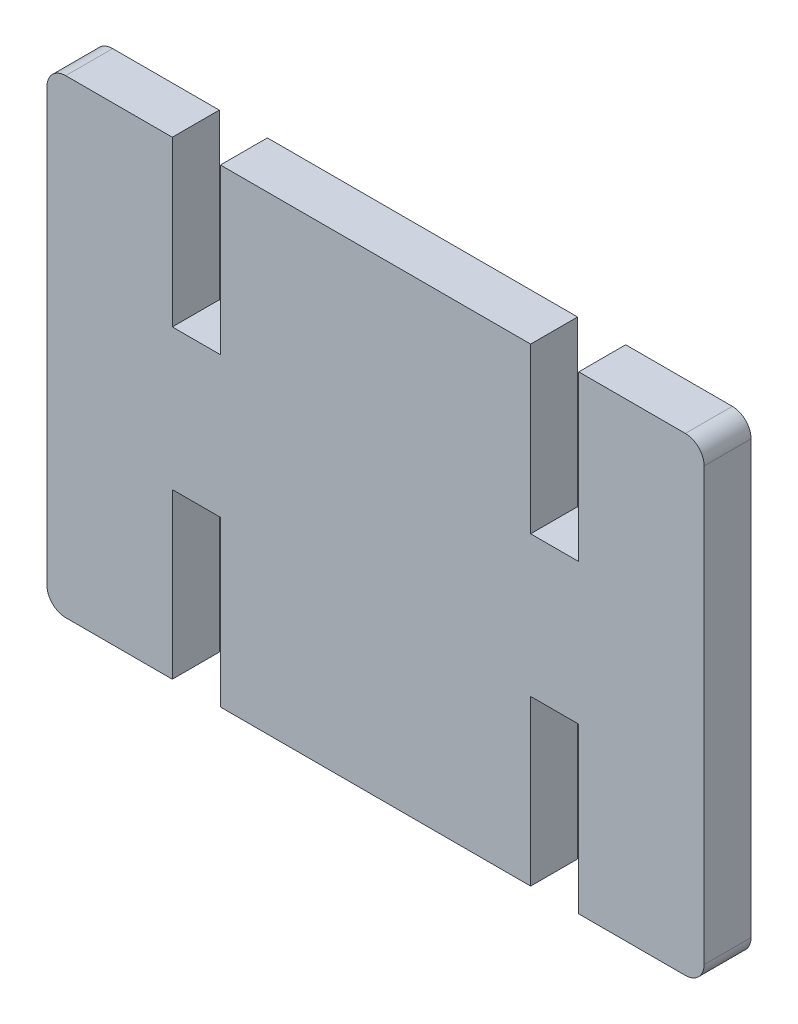
ISO-10303-21;
HEADER;
FILE_DESCRIPTION(('STEP AP214'),'2;1');
FILE_NAME('part.step','',(''),(''),'','','');
FILE_SCHEMA(('AUTOMOTIVE_DESIGN { 1 0 10303 214 1 1 1 1 }'));
ENDSEC;
DATA;
#1=APPLICATION_CONTEXT('core data for automotive mechanical design processes');
#2=APPLICATION_PROTOCOL_DEFINITION('international standard','automotive_design',2000,#1);
#3=PRODUCT_CONTEXT('',#1,'mechanical');
#4=PRODUCT('Part','Part','',(#3));
#5=PRODUCT_RELATED_PRODUCT_CATEGORY('part','',(#4));
#6=PRODUCT_DEFINITION_FORMATION('','',#4);
#7=PRODUCT_DEFINITION_CONTEXT('part definition',#1,'design');
#8=PRODUCT_DEFINITION('design','',#6,#7);
#9=PRODUCT_DEFINITION_SHAPE('','',#8);
#10=(LENGTH_UNIT() NAMED_UNIT(*) SI_UNIT(.MILLI.,.METRE.));
#11=(NAMED_UNIT(*) PLANE_ANGLE_UNIT() SI_UNIT($,.RADIAN.));
#12=(NAMED_UNIT(*) SI_UNIT($,.STERADIAN.) SOLID_ANGLE_UNIT());
#13=UNCERTAINTY_MEASURE_WITH_UNIT(LENGTH_MEASURE(1.E-05),#10,'distance_accuracy_value','');
#14=(GEOMETRIC_REPRESENTATION_CONTEXT(3) GLOBAL_UNCERTAINTY_ASSIGNED_CONTEXT((#13)) GLOBAL_UNIT_ASSIGNED_CONTEXT((#10,
#11,#12)) REPRESENTATION_CONTEXT('',''));
#15=CARTESIAN_POINT('',(0.,0.,0.));
#16=DIRECTION('',(0.,0.,1.));
#17=DIRECTION('',(1.,0.,0.));
#18=AXIS2_PLACEMENT_3D('',#15,#16,#17);
#19=CARTESIAN_POINT('',(2.00000000000001,0.,5.));
#20=DIRECTION('',(0.,1.,0.));
#21=DIRECTION('',(0.,0.,1.));
#22=AXIS2_PLACEMENT_3D('',#19,#20,#21);
#23=PLANE('',#22);
#24=DIRECTION('',(1.,0.,0.));
#25=VECTOR('',#24,1.);
#26=CARTESIAN_POINT('',(2.00000000000001,0.,0.));
#27=LINE('',#26,#25);
#28=CARTESIAN_POINT('',(18.479570248246,0.,0.));
#29=VERTEX_POINT('',#28);
#30=CARTESIAN_POINT('',(51.5204297517541,0.,0.));
#31=VERTEX_POINT('',#30);
#32=EDGE_CURVE('E217',#29,#31,#27,.T.);
#33=ORIENTED_EDGE('',*,*,#32,.T.);
#34=DIRECTION('',(0.,0.,1.));
#35=VECTOR('',#34,1.);
#36=CARTESIAN_POINT('',(51.5204297517541,0.,0.));
#37=LINE('',#36,#35);
#38=CARTESIAN_POINT('',(51.5204297517541,0.,5.00000000000002));
#39=VERTEX_POINT('',#38);
#40=EDGE_CURVE('E367',#31,#39,#37,.T.);
#41=ORIENTED_EDGE('',*,*,#40,.T.);
#42=DIRECTION('',(1.,0.,0.));
#43=VECTOR('',#42,1.);
#44=CARTESIAN_POINT('',(2.00000000000001,0.,5.));
#45=LINE('',#44,#43);
#46=CARTESIAN_POINT('',(18.479570248246,0.,5.00000000000002));
#47=VERTEX_POINT('',#46);
#48=EDGE_CURVE('E285',#47,#39,#45,.T.);
#49=ORIENTED_EDGE('',*,*,#48,.F.);
#50=DIRECTION('',(0.,0.,1.));
#51=VECTOR('',#50,1.);
#52=CARTESIAN_POINT('',(18.479570248246,0.,0.));
#53=LINE('',#52,#51);
#54=EDGE_CURVE('E350',#29,#47,#53,.T.);
#55=ORIENTED_EDGE('',*,*,#54,.F.);
#56=EDGE_LOOP('',(#33,#41,#49,#55));
#57=FACE_BOUND('',#56,.T.);
#58=ADVANCED_FACE('F33',(#57),#23,.F.);
#59=CARTESIAN_POINT('',(2.00000000000001,0.,0.));
#60=VERTEX_POINT('',#59);
#61=CARTESIAN_POINT('',(13.354570248246,0.,0.));
#62=VERTEX_POINT('',#61);
#63=EDGE_CURVE('E220',#60,#62,#27,.T.);
#64=ORIENTED_EDGE('',*,*,#63,.T.);
#65=DIRECTION('',(0.,0.,1.));
#66=VECTOR('',#65,1.);
#67=CARTESIAN_POINT('',(13.354570248246,0.,0.));
#68=LINE('',#67,#66);
#69=CARTESIAN_POINT('',(13.354570248246,0.,5.00000000000002));
#70=VERTEX_POINT('',#69);
#71=EDGE_CURVE('E342',#62,#70,#68,.T.);
#72=ORIENTED_EDGE('',*,*,#71,.T.);
#73=CARTESIAN_POINT('',(2.00000000000001,0.,5.));
#74=VERTEX_POINT('',#73);
#75=EDGE_CURVE('E282',#74,#70,#45,.T.);
#76=ORIENTED_EDGE('',*,*,#75,.F.);
#77=DIRECTION('',(0.,0.,-1.));
#78=VECTOR('',#77,1.);
#79=CARTESIAN_POINT('',(2.00000000000001,0.,5.));
#80=LINE('',#79,#78);
#81=EDGE_CURVE('E245',#74,#60,#80,.T.);
#82=ORIENTED_EDGE('',*,*,#81,.T.);
#83=EDGE_LOOP('',(#64,#72,#76,#82));
#84=FACE_BOUND('',#83,.T.);
#85=ADVANCED_FACE('F406',(#84),#23,.F.);
#86=CARTESIAN_POINT('',(2.00000000000001,50.,5.));
#87=DIRECTION('',(0.,-1.,0.));
#88=DIRECTION('',(0.,0.,-1.));
#89=AXIS2_PLACEMENT_3D('',#86,#87,#88);
#90=PLANE('',#89);
#91=DIRECTION('',(-1.,0.,0.));
#92=VECTOR('',#91,1.);
#93=CARTESIAN_POINT('',(2.00000000000001,50.,5.));
#94=LINE('',#93,#92);
#95=CARTESIAN_POINT('',(51.520429751754,50.,5.00000000000002));
#96=VERTEX_POINT('',#95);
#97=CARTESIAN_POINT('',(18.479570248246,50.,5.00000000000002));
#98=VERTEX_POINT('',#97);
#99=EDGE_CURVE('E294',#96,#98,#94,.T.);
#100=ORIENTED_EDGE('',*,*,#99,.F.);
#101=DIRECTION('',(0.,0.,1.));
#102=VECTOR('',#101,1.);
#103=CARTESIAN_POINT('',(51.520429751754,50.,0.));
#104=LINE('',#103,#102);
#105=CARTESIAN_POINT('',(51.520429751754,50.,0.));
#106=VERTEX_POINT('',#105);
#107=EDGE_CURVE('E330',#106,#96,#104,.T.);
#108=ORIENTED_EDGE('',*,*,#107,.F.);
#109=DIRECTION('',(-1.,0.,0.));
#110=VECTOR('',#109,1.);
#111=CARTESIAN_POINT('',(2.00000000000001,50.,0.));
#112=LINE('',#111,#110);
#113=CARTESIAN_POINT('',(18.479570248246,50.,0.));
#114=VERTEX_POINT('',#113);
#115=EDGE_CURVE('E272',#106,#114,#112,.T.);
#116=ORIENTED_EDGE('',*,*,#115,.T.);
#117=DIRECTION('',(0.,0.,1.));
#118=VECTOR('',#117,1.);
#119=CARTESIAN_POINT('',(18.479570248246,50.,0.));
#120=LINE('',#119,#118);
#121=EDGE_CURVE('E300',#114,#98,#120,.T.);
#122=ORIENTED_EDGE('',*,*,#121,.T.);
#123=EDGE_LOOP('',(#100,#108,#116,#122));
#124=FACE_BOUND('',#123,.T.);
#125=ADVANCED_FACE('F429',(#124),#90,.F.);
#126=CARTESIAN_POINT('',(13.354570248246,50.,5.00000000000002));
#127=VERTEX_POINT('',#126);
#128=CARTESIAN_POINT('',(2.00000000000001,50.,5.));
#129=VERTEX_POINT('',#128);
#130=EDGE_CURVE('E295',#127,#129,#94,.T.);
#131=ORIENTED_EDGE('',*,*,#130,.F.);
#132=DIRECTION('',(0.,0.,1.));
#133=VECTOR('',#132,1.);
#134=CARTESIAN_POINT('',(13.354570248246,50.,0.));
#135=LINE('',#134,#133);
#136=CARTESIAN_POINT('',(13.354570248246,50.,0.));
#137=VERTEX_POINT('',#136);
#138=EDGE_CURVE('E304',#137,#127,#135,.T.);
#139=ORIENTED_EDGE('',*,*,#138,.F.);
#140=CARTESIAN_POINT('',(2.00000000000001,50.,0.));
#141=VERTEX_POINT('',#140);
#142=EDGE_CURVE('E266',#137,#141,#112,.T.);
#143=ORIENTED_EDGE('',*,*,#142,.T.);
#144=DIRECTION('',(0.,0.,-1.));
#145=VECTOR('',#144,1.);
#146=CARTESIAN_POINT('',(2.00000000000001,50.,5.));
#147=LINE('',#146,#145);
#148=EDGE_CURVE('E41',#129,#141,#147,.T.);
#149=ORIENTED_EDGE('',*,*,#148,.F.);
#150=EDGE_LOOP('',(#131,#139,#143,#149));
#151=FACE_BOUND('',#150,.T.);
#152=ADVANCED_FACE('F509',(#151),#90,.F.);
#153=CARTESIAN_POINT('',(68.,48.,5.));
#154=DIRECTION('',(0.,0.,-1.));
#155=DIRECTION('',(-1.,0.,0.));
#156=AXIS2_PLACEMENT_3D('',#153,#154,#155);
#157=CYLINDRICAL_SURFACE('',#156,2.);
#158=CARTESIAN_POINT('',(68.,48.,0.));
#159=DIRECTION('',(0.,0.,1.));
#160=DIRECTION('',(1.,0.,0.));
#161=AXIS2_PLACEMENT_3D('',#158,#159,#160);
#162=CIRCLE('',#161,2.);
#163=CARTESIAN_POINT('',(70.,48.,0.));
#164=VERTEX_POINT('',#163);
#165=CARTESIAN_POINT('',(68.,50.,0.));
#166=VERTEX_POINT('',#165);
#167=EDGE_CURVE('E275',#164,#166,#162,.T.);
#168=ORIENTED_EDGE('',*,*,#167,.T.);
#169=DIRECTION('',(0.,0.,-1.));
#170=VECTOR('',#169,1.);
#171=CARTESIAN_POINT('',(68.,50.,5.));
#172=LINE('',#171,#170);
#173=CARTESIAN_POINT('',(68.,50.,5.));
#174=VERTEX_POINT('',#173);
#175=EDGE_CURVE('E11',#174,#166,#172,.T.);
#176=ORIENTED_EDGE('',*,*,#175,.F.);
#177=CARTESIAN_POINT('',(68.,48.,5.));
#178=DIRECTION('',(0.,0.,1.));
#179=DIRECTION('',(1.,0.,0.));
#180=AXIS2_PLACEMENT_3D('',#177,#178,#179);
#181=CIRCLE('',#180,2.);
#182=CARTESIAN_POINT('',(70.,48.,5.));
#183=VERTEX_POINT('',#182);
#184=EDGE_CURVE('E234',#183,#174,#181,.T.);
#185=ORIENTED_EDGE('',*,*,#184,.F.);
#186=DIRECTION('',(0.,0.,-1.));
#187=VECTOR('',#186,1.);
#188=CARTESIAN_POINT('',(70.,48.,5.));
#189=LINE('',#188,#187);
#190=EDGE_CURVE('E237',#183,#164,#189,.T.);
#191=ORIENTED_EDGE('',*,*,#190,.T.);
#192=EDGE_LOOP('',(#168,#176,#185,#191));
#193=FACE_BOUND('',#192,.T.);
#194=ADVANCED_FACE('F35',(#193),#157,.T.);
#195=CARTESIAN_POINT('',(56.645429751754,50.,0.));
#196=VERTEX_POINT('',#195);
#197=EDGE_CURVE('E268',#166,#196,#112,.T.);
#198=ORIENTED_EDGE('',*,*,#197,.T.);
#199=DIRECTION('',(0.,0.,1.));
#200=VECTOR('',#199,1.);
#201=CARTESIAN_POINT('',(56.645429751754,50.,0.));
#202=LINE('',#201,#200);
#203=CARTESIAN_POINT('',(56.645429751754,50.,5.00000000000002));
#204=VERTEX_POINT('',#203);
#205=EDGE_CURVE('E326',#196,#204,#202,.T.);
#206=ORIENTED_EDGE('',*,*,#205,.T.);
#207=EDGE_CURVE('E291',#174,#204,#94,.T.);
#208=ORIENTED_EDGE('',*,*,#207,.F.);
#209=ORIENTED_EDGE('',*,*,#175,.T.);
#210=EDGE_LOOP('',(#198,#206,#208,#209));
#211=FACE_BOUND('',#210,.T.);
#212=ADVANCED_FACE('F422',(#211),#90,.F.);
#213=CARTESIAN_POINT('',(2.,48.,5.));
#214=DIRECTION('',(0.,0.,-1.));
#215=DIRECTION('',(-1.,0.,0.));
#216=AXIS2_PLACEMENT_3D('',#213,#214,#215);
#217=CYLINDRICAL_SURFACE('',#216,2.);
#218=CARTESIAN_POINT('',(2.,48.,0.));
#219=DIRECTION('',(0.,0.,1.));
#220=DIRECTION('',(-1.,0.,0.));
#221=AXIS2_PLACEMENT_3D('',#218,#219,#220);
#222=CIRCLE('',#221,2.);
#223=CARTESIAN_POINT('',(0.,48.,0.));
#224=VERTEX_POINT('',#223);
#225=EDGE_CURVE('E259',#141,#224,#222,.T.);
#226=ORIENTED_EDGE('',*,*,#225,.T.);
#227=DIRECTION('',(0.,0.,-1.));
#228=VECTOR('',#227,1.);
#229=CARTESIAN_POINT('',(0.,48.,5.));
#230=LINE('',#229,#228);
#231=CARTESIAN_POINT('',(0.,48.,5.));
#232=VERTEX_POINT('',#231);
#233=EDGE_CURVE('E250',#232,#224,#230,.T.);
#234=ORIENTED_EDGE('',*,*,#233,.F.);
#235=CARTESIAN_POINT('',(2.,48.,5.));
#236=DIRECTION('',(0.,0.,1.));
#237=DIRECTION('',(-1.,0.,0.));
#238=AXIS2_PLACEMENT_3D('',#235,#236,#237);
#239=CIRCLE('',#238,2.);
#240=EDGE_CURVE('E260',#129,#232,#239,.T.);
#241=ORIENTED_EDGE('',*,*,#240,.F.);
#242=ORIENTED_EDGE('',*,*,#148,.T.);
#243=EDGE_LOOP('',(#226,#234,#241,#242));
#244=FACE_BOUND('',#243,.T.);
#245=ADVANCED_FACE('F257',(#244),#217,.T.);
#246=CARTESIAN_POINT('',(0.,2.00000000000001,5.));
#247=DIRECTION('',(1.,0.,0.));
#248=DIRECTION('',(0.,1.,0.));
#249=AXIS2_PLACEMENT_3D('',#246,#247,#248);
#250=PLANE('',#249);
#251=DIRECTION('',(0.,-1.,0.));
#252=VECTOR('',#251,1.);
#253=CARTESIAN_POINT('',(0.,2.00000000000001,0.));
#254=LINE('',#253,#252);
#255=CARTESIAN_POINT('',(0.,2.00000000000001,0.));
#256=VERTEX_POINT('',#255);
#257=EDGE_CURVE('E222',#224,#256,#254,.T.);
#258=ORIENTED_EDGE('',*,*,#257,.T.);
#259=DIRECTION('',(0.,0.,-1.));
#260=VECTOR('',#259,1.);
#261=CARTESIAN_POINT('',(0.,2.00000000000001,5.));
#262=LINE('',#261,#260);
#263=CARTESIAN_POINT('',(0.,2.00000000000001,5.));
#264=VERTEX_POINT('',#263);
#265=EDGE_CURVE('E247',#264,#256,#262,.T.);
#266=ORIENTED_EDGE('',*,*,#265,.F.);
#267=DIRECTION('',(0.,-1.,0.));
#268=VECTOR('',#267,1.);
#269=CARTESIAN_POINT('',(0.,2.00000000000001,5.));
#270=LINE('',#269,#268);
#271=EDGE_CURVE('E288',#232,#264,#270,.T.);
#272=ORIENTED_EDGE('',*,*,#271,.F.);
#273=ORIENTED_EDGE('',*,*,#233,.T.);
#274=EDGE_LOOP('',(#258,#266,#272,#273));
#275=FACE_BOUND('',#274,.T.);
#276=ADVANCED_FACE('F414',(#275),#250,.F.);
#277=CARTESIAN_POINT('',(2.,2.,5.));
#278=DIRECTION('',(0.,0.,-1.));
#279=DIRECTION('',(-1.,0.,0.));
#280=AXIS2_PLACEMENT_3D('',#277,#278,#279);
#281=CYLINDRICAL_SURFACE('',#280,2.);
#282=CARTESIAN_POINT('',(2.,2.,0.));
#283=DIRECTION('',(0.,0.,1.));
#284=DIRECTION('',(1.,0.,0.));
#285=AXIS2_PLACEMENT_3D('',#282,#283,#284);
#286=CIRCLE('',#285,2.);
#287=EDGE_CURVE('E218',#256,#60,#286,.T.);
#288=ORIENTED_EDGE('',*,*,#287,.T.);
#289=ORIENTED_EDGE('',*,*,#81,.F.);
#290=CARTESIAN_POINT('',(2.,2.,5.));
#291=DIRECTION('',(0.,0.,1.));
#292=DIRECTION('',(1.,0.,0.));
#293=AXIS2_PLACEMENT_3D('',#290,#291,#292);
#294=CIRCLE('',#293,2.);
#295=EDGE_CURVE('E286',#264,#74,#294,.T.);
#296=ORIENTED_EDGE('',*,*,#295,.F.);
#297=ORIENTED_EDGE('',*,*,#265,.T.);
#298=EDGE_LOOP('',(#288,#289,#296,#297));
#299=FACE_BOUND('',#298,.T.);
#300=ADVANCED_FACE('F412',(#299),#281,.T.);
#301=CARTESIAN_POINT('',(56.645429751754,0.,5.00000000000002));
#302=VERTEX_POINT('',#301);
#303=CARTESIAN_POINT('',(68.,0.,5.));
#304=VERTEX_POINT('',#303);
#305=EDGE_CURVE('E210',#302,#304,#45,.T.);
#306=ORIENTED_EDGE('',*,*,#305,.F.);
#307=DIRECTION('',(0.,0.,1.));
#308=VECTOR('',#307,1.);
#309=CARTESIAN_POINT('',(56.645429751754,0.,0.));
#310=LINE('',#309,#308);
#311=CARTESIAN_POINT('',(56.645429751754,0.,0.));
#312=VERTEX_POINT('',#311);
#313=EDGE_CURVE('E197',#312,#302,#310,.T.);
#314=ORIENTED_EDGE('',*,*,#313,.F.);
#315=CARTESIAN_POINT('',(68.,0.,0.));
#316=VERTEX_POINT('',#315);
#317=EDGE_CURVE('E208',#312,#316,#27,.T.);
#318=ORIENTED_EDGE('',*,*,#317,.T.);
#319=DIRECTION('',(0.,0.,-1.));
#320=VECTOR('',#319,1.);
#321=CARTESIAN_POINT('',(68.,0.,5.));
#322=LINE('',#321,#320);
#323=EDGE_CURVE('E243',#304,#316,#322,.T.);
#324=ORIENTED_EDGE('',*,*,#323,.F.);
#325=EDGE_LOOP('',(#306,#314,#318,#324));
#326=FACE_BOUND('',#325,.T.);
#327=ADVANCED_FACE('F206',(#326),#23,.F.);
#328=CARTESIAN_POINT('',(68.,2.,5.));
#329=DIRECTION('',(0.,0.,-1.));
#330=DIRECTION('',(-1.,0.,0.));
#331=AXIS2_PLACEMENT_3D('',#328,#329,#330);
#332=CYLINDRICAL_SURFACE('',#331,2.);
#333=CARTESIAN_POINT('',(68.,2.,0.));
#334=DIRECTION('',(0.,0.,1.));
#335=DIRECTION('',(1.,0.,0.));
#336=AXIS2_PLACEMENT_3D('',#333,#334,#335);
#337=CIRCLE('',#336,2.);
#338=CARTESIAN_POINT('',(70.,2.,0.));
#339=VERTEX_POINT('',#338);
#340=EDGE_CURVE('E216',#316,#339,#337,.T.);
#341=ORIENTED_EDGE('',*,*,#340,.T.);
#342=DIRECTION('',(0.,0.,-1.));
#343=VECTOR('',#342,1.);
#344=CARTESIAN_POINT('',(70.,2.,5.));
#345=LINE('',#344,#343);
#346=CARTESIAN_POINT('',(70.,2.,5.));
#347=VERTEX_POINT('',#346);
#348=EDGE_CURVE('E240',#347,#339,#345,.T.);
#349=ORIENTED_EDGE('',*,*,#348,.F.);
#350=CARTESIAN_POINT('',(68.,2.,5.));
#351=DIRECTION('',(0.,0.,1.));
#352=DIRECTION('',(1.,0.,0.));
#353=AXIS2_PLACEMENT_3D('',#350,#351,#352);
#354=CIRCLE('',#353,2.);
#355=EDGE_CURVE('E280',#304,#347,#354,.T.);
#356=ORIENTED_EDGE('',*,*,#355,.F.);
#357=ORIENTED_EDGE('',*,*,#323,.T.);
#358=EDGE_LOOP('',(#341,#349,#356,#357));
#359=FACE_BOUND('',#358,.T.);
#360=ADVANCED_FACE('F432',(#359),#332,.T.);
#361=CARTESIAN_POINT('',(70.,2.,5.));
#362=DIRECTION('',(-1.,0.,0.));
#363=DIRECTION('',(0.,-1.,0.));
#364=AXIS2_PLACEMENT_3D('',#361,#362,#363);
#365=PLANE('',#364);
#366=DIRECTION('',(0.,1.,0.));
#367=VECTOR('',#366,1.);
#368=CARTESIAN_POINT('',(70.,2.,0.));
#369=LINE('',#368,#367);
#370=EDGE_CURVE('E230',#339,#164,#369,.T.);
#371=ORIENTED_EDGE('',*,*,#370,.T.);
#372=ORIENTED_EDGE('',*,*,#190,.F.);
#373=DIRECTION('',(0.,1.,0.));
#374=VECTOR('',#373,1.);
#375=CARTESIAN_POINT('',(70.,2.,5.));
#376=LINE('',#375,#374);
#377=EDGE_CURVE('E241',#347,#183,#376,.T.);
#378=ORIENTED_EDGE('',*,*,#377,.F.);
#379=ORIENTED_EDGE('',*,*,#348,.T.);
#380=EDGE_LOOP('',(#371,#372,#378,#379));
#381=FACE_BOUND('',#380,.T.);
#382=ADVANCED_FACE('F436',(#381),#365,.F.);
#383=CARTESIAN_POINT('',(68.,48.,5.));
#384=DIRECTION('',(0.,0.,1.));
#385=DIRECTION('',(1.,0.,0.));
#386=AXIS2_PLACEMENT_3D('',#383,#384,#385);
#387=PLANE('',#386);
#388=DIRECTION('',(0.,-1.,0.));
#389=VECTOR('',#388,1.);
#390=CARTESIAN_POINT('',(51.5204297517541,0.,5.00000000000002));
#391=LINE('',#390,#389);
#392=CARTESIAN_POINT('',(51.5204297517541,17.5,5.00000000000002));
#393=VERTEX_POINT('',#392);
#394=EDGE_CURVE('E202',#393,#39,#391,.T.);
#395=ORIENTED_EDGE('',*,*,#394,.F.);
#396=DIRECTION('',(-1.,0.,0.));
#397=VECTOR('',#396,1.);
#398=CARTESIAN_POINT('',(51.5204297517541,17.5,5.00000000000002));
#399=LINE('',#398,#397);
#400=CARTESIAN_POINT('',(56.645429751754,17.5,5.00000000000002));
#401=VERTEX_POINT('',#400);
#402=EDGE_CURVE('E379',#401,#393,#399,.T.);
#403=ORIENTED_EDGE('',*,*,#402,.F.);
#404=DIRECTION('',(0.,1.,0.));
#405=VECTOR('',#404,1.);
#406=CARTESIAN_POINT('',(56.645429751754,0.,5.00000000000002));
#407=LINE('',#406,#405);
#408=EDGE_CURVE('E382',#302,#401,#407,.T.);
#409=ORIENTED_EDGE('',*,*,#408,.F.);
#410=ORIENTED_EDGE('',*,*,#305,.T.);
#411=ORIENTED_EDGE('',*,*,#355,.T.);
#412=ORIENTED_EDGE('',*,*,#377,.T.);
#413=ORIENTED_EDGE('',*,*,#184,.T.);
#414=ORIENTED_EDGE('',*,*,#207,.T.);
#415=DIRECTION('',(0.,1.,0.));
#416=VECTOR('',#415,1.);
#417=CARTESIAN_POINT('',(56.645429751754,50.,5.00000000000002));
#418=LINE('',#417,#416);
#419=CARTESIAN_POINT('',(56.645429751754,32.5,5.00000000000002));
#420=VERTEX_POINT('',#419);
#421=EDGE_CURVE('E337',#420,#204,#418,.T.);
#422=ORIENTED_EDGE('',*,*,#421,.F.);
#423=DIRECTION('',(1.,0.,0.));
#424=VECTOR('',#423,1.);
#425=CARTESIAN_POINT('',(56.645429751754,32.5,5.00000000000002));
#426=LINE('',#425,#424);
#427=CARTESIAN_POINT('',(51.5204297517541,32.5,5.00000000000002));
#428=VERTEX_POINT('',#427);
#429=EDGE_CURVE('E339',#428,#420,#426,.T.);
#430=ORIENTED_EDGE('',*,*,#429,.F.);
#431=DIRECTION('',(0.,-1.,0.));
#432=VECTOR('',#431,1.);
#433=CARTESIAN_POINT('',(51.5204297517541,32.5,5.00000000000002));
#434=LINE('',#433,#432);
#435=EDGE_CURVE('E333',#96,#428,#434,.T.);
#436=ORIENTED_EDGE('',*,*,#435,.F.);
#437=ORIENTED_EDGE('',*,*,#99,.T.);
#438=DIRECTION('',(0.,1.,0.));
#439=VECTOR('',#438,1.);
#440=CARTESIAN_POINT('',(18.479570248246,50.,5.00000000000002));
#441=LINE('',#440,#439);
#442=CARTESIAN_POINT('',(18.479570248246,32.5,5.00000000000002));
#443=VERTEX_POINT('',#442);
#444=EDGE_CURVE('E311',#443,#98,#441,.T.);
#445=ORIENTED_EDGE('',*,*,#444,.F.);
#446=DIRECTION('',(1.,0.,0.));
#447=VECTOR('',#446,1.);
#448=CARTESIAN_POINT('',(13.354570248246,32.5,5.00000000000002));
#449=LINE('',#448,#447);
#450=CARTESIAN_POINT('',(13.354570248246,32.5,5.00000000000002));
#451=VERTEX_POINT('',#450);
#452=EDGE_CURVE('E314',#451,#443,#449,.T.);
#453=ORIENTED_EDGE('',*,*,#452,.F.);
#454=DIRECTION('',(0.,-1.,0.));
#455=VECTOR('',#454,1.);
#456=CARTESIAN_POINT('',(13.354570248246,32.5,5.00000000000002));
#457=LINE('',#456,#455);
#458=EDGE_CURVE('E307',#127,#451,#457,.T.);
#459=ORIENTED_EDGE('',*,*,#458,.F.);
#460=ORIENTED_EDGE('',*,*,#130,.T.);
#461=ORIENTED_EDGE('',*,*,#240,.T.);
#462=ORIENTED_EDGE('',*,*,#271,.T.);
#463=ORIENTED_EDGE('',*,*,#295,.T.);
#464=ORIENTED_EDGE('',*,*,#75,.T.);
#465=DIRECTION('',(0.,-1.,0.));
#466=VECTOR('',#465,1.);
#467=CARTESIAN_POINT('',(13.354570248246,0.,5.00000000000002));
#468=LINE('',#467,#466);
#469=CARTESIAN_POINT('',(13.354570248246,17.5,5.00000000000002));
#470=VERTEX_POINT('',#469);
#471=EDGE_CURVE('E358',#470,#70,#468,.T.);
#472=ORIENTED_EDGE('',*,*,#471,.F.);
#473=DIRECTION('',(-1.,0.,0.));
#474=VECTOR('',#473,1.);
#475=CARTESIAN_POINT('',(13.354570248246,17.5,5.00000000000002));
#476=LINE('',#475,#474);
#477=CARTESIAN_POINT('',(18.479570248246,17.5,5.00000000000002));
#478=VERTEX_POINT('',#477);
#479=EDGE_CURVE('E361',#478,#470,#476,.T.);
#480=ORIENTED_EDGE('',*,*,#479,.F.);
#481=DIRECTION('',(0.,1.,0.));
#482=VECTOR('',#481,1.);
#483=CARTESIAN_POINT('',(18.479570248246,0.,5.00000000000002));
#484=LINE('',#483,#482);
#485=EDGE_CURVE('E364',#47,#478,#484,.T.);
#486=ORIENTED_EDGE('',*,*,#485,.F.);
#487=ORIENTED_EDGE('',*,*,#48,.T.);
#488=EDGE_LOOP('',(#395,#403,#409,#410,#411,#412,#413,#414,#422,#430,#436,#437,#445,#453,#459,
#460,#461,#462,#463,#464,#472,#480,#486,#487));
#489=FACE_BOUND('',#488,.T.);
#490=ADVANCED_FACE('F399',(#489),#387,.T.);
#491=CARTESIAN_POINT('',(68.,48.,0.));
#492=DIRECTION('',(0.,0.,1.));
#493=DIRECTION('',(1.,0.,0.));
#494=AXIS2_PLACEMENT_3D('',#491,#492,#493);
#495=PLANE('',#494);
#496=DIRECTION('',(-1.,0.,0.));
#497=VECTOR('',#496,1.);
#498=CARTESIAN_POINT('',(51.5204297517541,17.5,0.));
#499=LINE('',#498,#497);
#500=CARTESIAN_POINT('',(56.645429751754,17.5,0.));
#501=VERTEX_POINT('',#500);
#502=CARTESIAN_POINT('',(51.5204297517541,17.5,0.));
#503=VERTEX_POINT('',#502);
#504=EDGE_CURVE('E48',#501,#503,#499,.T.);
#505=ORIENTED_EDGE('',*,*,#504,.T.);
#506=DIRECTION('',(0.,-1.,0.));
#507=VECTOR('',#506,1.);
#508=CARTESIAN_POINT('',(51.5204297517541,0.,0.));
#509=LINE('',#508,#507);
#510=EDGE_CURVE('E211',#503,#31,#509,.T.);
#511=ORIENTED_EDGE('',*,*,#510,.T.);
#512=ORIENTED_EDGE('',*,*,#32,.F.);
#513=DIRECTION('',(0.,1.,0.));
#514=VECTOR('',#513,1.);
#515=CARTESIAN_POINT('',(18.479570248246,0.,0.));
#516=LINE('',#515,#514);
#517=CARTESIAN_POINT('',(18.479570248246,17.5,0.));
#518=VERTEX_POINT('',#517);
#519=EDGE_CURVE('E360',#29,#518,#516,.T.);
#520=ORIENTED_EDGE('',*,*,#519,.T.);
#521=DIRECTION('',(-1.,0.,0.));
#522=VECTOR('',#521,1.);
#523=CARTESIAN_POINT('',(13.354570248246,17.5,0.));
#524=LINE('',#523,#522);
#525=CARTESIAN_POINT('',(13.354570248246,17.5,0.));
#526=VERTEX_POINT('',#525);
#527=EDGE_CURVE('E56',#518,#526,#524,.T.);
#528=ORIENTED_EDGE('',*,*,#527,.T.);
#529=DIRECTION('',(0.,-1.,0.));
#530=VECTOR('',#529,1.);
#531=CARTESIAN_POINT('',(13.354570248246,0.,0.));
#532=LINE('',#531,#530);
#533=EDGE_CURVE('E353',#526,#62,#532,.T.);
#534=ORIENTED_EDGE('',*,*,#533,.T.);
#535=ORIENTED_EDGE('',*,*,#63,.F.);
#536=ORIENTED_EDGE('',*,*,#287,.F.);
#537=ORIENTED_EDGE('',*,*,#257,.F.);
#538=ORIENTED_EDGE('',*,*,#225,.F.);
#539=ORIENTED_EDGE('',*,*,#142,.F.);
#540=DIRECTION('',(0.,-1.,0.));
#541=VECTOR('',#540,1.);
#542=CARTESIAN_POINT('',(13.354570248246,32.5,0.));
#543=LINE('',#542,#541);
#544=CARTESIAN_POINT('',(13.354570248246,32.5,0.));
#545=VERTEX_POINT('',#544);
#546=EDGE_CURVE('E301',#137,#545,#543,.T.);
#547=ORIENTED_EDGE('',*,*,#546,.T.);
#548=DIRECTION('',(1.,0.,0.));
#549=VECTOR('',#548,1.);
#550=CARTESIAN_POINT('',(13.354570248246,32.5,0.));
#551=LINE('',#550,#549);
#552=CARTESIAN_POINT('',(18.479570248246,32.5,0.));
#553=VERTEX_POINT('',#552);
#554=EDGE_CURVE('E310',#545,#553,#551,.T.);
#555=ORIENTED_EDGE('',*,*,#554,.T.);
#556=DIRECTION('',(0.,1.,0.));
#557=VECTOR('',#556,1.);
#558=CARTESIAN_POINT('',(18.479570248246,50.,0.));
#559=LINE('',#558,#557);
#560=EDGE_CURVE('E319',#553,#114,#559,.T.);
#561=ORIENTED_EDGE('',*,*,#560,.T.);
#562=ORIENTED_EDGE('',*,*,#115,.F.);
#563=DIRECTION('',(0.,-1.,0.));
#564=VECTOR('',#563,1.);
#565=CARTESIAN_POINT('',(51.5204297517541,32.5,0.));
#566=LINE('',#565,#564);
#567=CARTESIAN_POINT('',(51.5204297517541,32.5,0.));
#568=VERTEX_POINT('',#567);
#569=EDGE_CURVE('E327',#106,#568,#566,.T.);
#570=ORIENTED_EDGE('',*,*,#569,.T.);
#571=DIRECTION('',(1.,0.,0.));
#572=VECTOR('',#571,1.);
#573=CARTESIAN_POINT('',(56.645429751754,32.5,0.));
#574=LINE('',#573,#572);
#575=CARTESIAN_POINT('',(56.645429751754,32.5,0.));
#576=VERTEX_POINT('',#575);
#577=EDGE_CURVE('E336',#568,#576,#574,.T.);
#578=ORIENTED_EDGE('',*,*,#577,.T.);
#579=DIRECTION('',(0.,1.,0.));
#580=VECTOR('',#579,1.);
#581=CARTESIAN_POINT('',(56.645429751754,50.,0.));
#582=LINE('',#581,#580);
#583=EDGE_CURVE('E345',#576,#196,#582,.T.);
#584=ORIENTED_EDGE('',*,*,#583,.T.);
#585=ORIENTED_EDGE('',*,*,#197,.F.);
#586=ORIENTED_EDGE('',*,*,#167,.F.);
#587=ORIENTED_EDGE('',*,*,#370,.F.);
#588=ORIENTED_EDGE('',*,*,#340,.F.);
#589=ORIENTED_EDGE('',*,*,#317,.F.);
#590=DIRECTION('',(0.,1.,0.));
#591=VECTOR('',#590,1.);
#592=CARTESIAN_POINT('',(56.645429751754,0.,0.));
#593=LINE('',#592,#591);
#594=EDGE_CURVE('E193',#312,#501,#593,.T.);
#595=ORIENTED_EDGE('',*,*,#594,.T.);
#596=EDGE_LOOP('',(#505,#511,#512,#520,#528,#534,#535,#536,#537,#538,#539,#547,#555,#561,#562,
#570,#578,#584,#585,#586,#587,#588,#589,#595));
#597=FACE_BOUND('',#596,.T.);
#598=ADVANCED_FACE('F214',(#597),#495,.F.);
#599=CARTESIAN_POINT('',(13.354570248246,32.5,0.));
#600=DIRECTION('',(0.,-1.,0.));
#601=DIRECTION('',(0.,0.,-1.));
#602=AXIS2_PLACEMENT_3D('',#599,#600,#601);
#603=PLANE('',#602);
#604=ORIENTED_EDGE('',*,*,#452,.T.);
#605=DIRECTION('',(0.,0.,1.));
#606=VECTOR('',#605,1.);
#607=CARTESIAN_POINT('',(18.479570248246,32.5,0.));
#608=LINE('',#607,#606);
#609=EDGE_CURVE('E298',#553,#443,#608,.T.);
#610=ORIENTED_EDGE('',*,*,#609,.F.);
#611=ORIENTED_EDGE('',*,*,#554,.F.);
#612=DIRECTION('',(0.,0.,1.));
#613=VECTOR('',#612,1.);
#614=CARTESIAN_POINT('',(13.354570248246,32.5,0.));
#615=LINE('',#614,#613);
#616=EDGE_CURVE('E278',#545,#451,#615,.T.);
#617=ORIENTED_EDGE('',*,*,#616,.T.);
#618=EDGE_LOOP('',(#604,#610,#611,#617));
#619=FACE_BOUND('',#618,.T.);
#620=ADVANCED_FACE('F445',(#619),#603,.F.);
#621=CARTESIAN_POINT('',(13.354570248246,32.5,0.));
#622=DIRECTION('',(-1.,0.,0.));
#623=DIRECTION('',(0.,-1.,0.));
#624=AXIS2_PLACEMENT_3D('',#621,#622,#623);
#625=PLANE('',#624);
#626=ORIENTED_EDGE('',*,*,#458,.T.);
#627=ORIENTED_EDGE('',*,*,#616,.F.);
#628=ORIENTED_EDGE('',*,*,#546,.F.);
#629=ORIENTED_EDGE('',*,*,#138,.T.);
#630=EDGE_LOOP('',(#626,#627,#628,#629));
#631=FACE_BOUND('',#630,.T.);
#632=ADVANCED_FACE('F450',(#631),#625,.F.);
#633=CARTESIAN_POINT('',(18.479570248246,50.,0.));
#634=DIRECTION('',(1.,0.,0.));
#635=DIRECTION('',(0.,1.,0.));
#636=AXIS2_PLACEMENT_3D('',#633,#634,#635);
#637=PLANE('',#636);
#638=ORIENTED_EDGE('',*,*,#444,.T.);
#639=ORIENTED_EDGE('',*,*,#121,.F.);
#640=ORIENTED_EDGE('',*,*,#560,.F.);
#641=ORIENTED_EDGE('',*,*,#609,.T.);
#642=EDGE_LOOP('',(#638,#639,#640,#641));
#643=FACE_BOUND('',#642,.T.);
#644=ADVANCED_FACE('F452',(#643),#637,.F.);
#645=CARTESIAN_POINT('',(56.645429751754,32.5,0.));
#646=DIRECTION('',(0.,-1.,0.));
#647=DIRECTION('',(0.,0.,-1.));
#648=AXIS2_PLACEMENT_3D('',#645,#646,#647);
#649=PLANE('',#648);
#650=ORIENTED_EDGE('',*,*,#429,.T.);
#651=DIRECTION('',(0.,0.,1.));
#652=VECTOR('',#651,1.);
#653=CARTESIAN_POINT('',(56.645429751754,32.5,0.));
#654=LINE('',#653,#652);
#655=EDGE_CURVE('E324',#576,#420,#654,.T.);
#656=ORIENTED_EDGE('',*,*,#655,.F.);
#657=ORIENTED_EDGE('',*,*,#577,.F.);
#658=DIRECTION('',(0.,0.,1.));
#659=VECTOR('',#658,1.);
#660=CARTESIAN_POINT('',(51.5204297517541,32.5,0.));
#661=LINE('',#660,#659);
#662=EDGE_CURVE('E317',#568,#428,#661,.T.);
#663=ORIENTED_EDGE('',*,*,#662,.T.);
#664=EDGE_LOOP('',(#650,#656,#657,#663));
#665=FACE_BOUND('',#664,.T.);
#666=ADVANCED_FACE('F455',(#665),#649,.F.);
#667=CARTESIAN_POINT('',(51.5204297517541,32.5,0.));
#668=DIRECTION('',(-1.,0.,0.));
#669=DIRECTION('',(0.,-1.,0.));
#670=AXIS2_PLACEMENT_3D('',#667,#668,#669);
#671=PLANE('',#670);
#672=ORIENTED_EDGE('',*,*,#435,.T.);
#673=ORIENTED_EDGE('',*,*,#662,.F.);
#674=ORIENTED_EDGE('',*,*,#569,.F.);
#675=ORIENTED_EDGE('',*,*,#107,.T.);
#676=EDGE_LOOP('',(#672,#673,#674,#675));
#677=FACE_BOUND('',#676,.T.);
#678=ADVANCED_FACE('F462',(#677),#671,.F.);
#679=CARTESIAN_POINT('',(56.645429751754,50.,0.));
#680=DIRECTION('',(1.,0.,0.));
#681=DIRECTION('',(0.,1.,0.));
#682=AXIS2_PLACEMENT_3D('',#679,#680,#681);
#683=PLANE('',#682);
#684=ORIENTED_EDGE('',*,*,#421,.T.);
#685=ORIENTED_EDGE('',*,*,#205,.F.);
#686=ORIENTED_EDGE('',*,*,#583,.F.);
#687=ORIENTED_EDGE('',*,*,#655,.T.);
#688=EDGE_LOOP('',(#684,#685,#686,#687));
#689=FACE_BOUND('',#688,.T.);
#690=ADVANCED_FACE('F464',(#689),#683,.F.);
#691=CARTESIAN_POINT('',(13.354570248246,0.,0.));
#692=DIRECTION('',(-1.,0.,0.));
#693=DIRECTION('',(0.,-1.,0.));
#694=AXIS2_PLACEMENT_3D('',#691,#692,#693);
#695=PLANE('',#694);
#696=ORIENTED_EDGE('',*,*,#471,.T.);
#697=ORIENTED_EDGE('',*,*,#71,.F.);
#698=ORIENTED_EDGE('',*,*,#533,.F.);
#699=DIRECTION('',(0.,0.,1.));
#700=VECTOR('',#699,1.);
#701=CARTESIAN_POINT('',(13.354570248246,17.5,0.));
#702=LINE('',#701,#700);
#703=EDGE_CURVE('E355',#526,#470,#702,.T.);
#704=ORIENTED_EDGE('',*,*,#703,.T.);
#705=EDGE_LOOP('',(#696,#697,#698,#704));
#706=FACE_BOUND('',#705,.T.);
#707=ADVANCED_FACE('F404',(#706),#695,.F.);
#708=CARTESIAN_POINT('',(13.354570248246,17.5,0.));
#709=DIRECTION('',(0.,1.,0.));
#710=DIRECTION('',(0.,0.,1.));
#711=AXIS2_PLACEMENT_3D('',#708,#709,#710);
#712=PLANE('',#711);
#713=ORIENTED_EDGE('',*,*,#479,.T.);
#714=ORIENTED_EDGE('',*,*,#703,.F.);
#715=ORIENTED_EDGE('',*,*,#527,.F.);
#716=DIRECTION('',(0.,0.,1.));
#717=VECTOR('',#716,1.);
#718=CARTESIAN_POINT('',(18.479570248246,17.5,0.));
#719=LINE('',#718,#717);
#720=EDGE_CURVE('E352',#518,#478,#719,.T.);
#721=ORIENTED_EDGE('',*,*,#720,.T.);
#722=EDGE_LOOP('',(#713,#714,#715,#721));
#723=FACE_BOUND('',#722,.T.);
#724=ADVANCED_FACE('F401',(#723),#712,.F.);
#725=CARTESIAN_POINT('',(18.479570248246,0.,0.));
#726=DIRECTION('',(1.,0.,0.));
#727=DIRECTION('',(0.,1.,0.));
#728=AXIS2_PLACEMENT_3D('',#725,#726,#727);
#729=PLANE('',#728);
#730=ORIENTED_EDGE('',*,*,#485,.T.);
#731=ORIENTED_EDGE('',*,*,#720,.F.);
#732=ORIENTED_EDGE('',*,*,#519,.F.);
#733=ORIENTED_EDGE('',*,*,#54,.T.);
#734=EDGE_LOOP('',(#730,#731,#732,#733));
#735=FACE_BOUND('',#734,.T.);
#736=ADVANCED_FACE('F395',(#735),#729,.F.);
#737=CARTESIAN_POINT('',(51.5204297517541,0.,0.));
#738=DIRECTION('',(-1.,0.,0.));
#739=DIRECTION('',(0.,-1.,0.));
#740=AXIS2_PLACEMENT_3D('',#737,#738,#739);
#741=PLANE('',#740);
#742=ORIENTED_EDGE('',*,*,#394,.T.);
#743=ORIENTED_EDGE('',*,*,#40,.F.);
#744=ORIENTED_EDGE('',*,*,#510,.F.);
#745=DIRECTION('',(0.,0.,1.));
#746=VECTOR('',#745,1.);
#747=CARTESIAN_POINT('',(51.5204297517541,17.5,0.));
#748=LINE('',#747,#746);
#749=EDGE_CURVE('E374',#503,#393,#748,.T.);
#750=ORIENTED_EDGE('',*,*,#749,.T.);
#751=EDGE_LOOP('',(#742,#743,#744,#750));
#752=FACE_BOUND('',#751,.T.);
#753=ADVANCED_FACE('F473',(#752),#741,.F.);
#754=CARTESIAN_POINT('',(51.5204297517541,17.5,0.));
#755=DIRECTION('',(0.,1.,0.));
#756=DIRECTION('',(0.,0.,1.));
#757=AXIS2_PLACEMENT_3D('',#754,#755,#756);
#758=PLANE('',#757);
#759=ORIENTED_EDGE('',*,*,#402,.T.);
#760=ORIENTED_EDGE('',*,*,#749,.F.);
#761=ORIENTED_EDGE('',*,*,#504,.F.);
#762=DIRECTION('',(0.,0.,1.));
#763=VECTOR('',#762,1.);
#764=CARTESIAN_POINT('',(56.645429751754,17.5,0.));
#765=LINE('',#764,#763);
#766=EDGE_CURVE('E199',#501,#401,#765,.T.);
#767=ORIENTED_EDGE('',*,*,#766,.T.);
#768=EDGE_LOOP('',(#759,#760,#761,#767));
#769=FACE_BOUND('',#768,.T.);
#770=ADVANCED_FACE('F480',(#769),#758,.F.);
#771=CARTESIAN_POINT('',(56.645429751754,0.,0.));
#772=DIRECTION('',(1.,0.,0.));
#773=DIRECTION('',(0.,1.,0.));
#774=AXIS2_PLACEMENT_3D('',#771,#772,#773);
#775=PLANE('',#774);
#776=ORIENTED_EDGE('',*,*,#408,.T.);
#777=ORIENTED_EDGE('',*,*,#766,.F.);
#778=ORIENTED_EDGE('',*,*,#594,.F.);
#779=ORIENTED_EDGE('',*,*,#313,.T.);
#780=EDGE_LOOP('',(#776,#777,#778,#779));
#781=FACE_BOUND('',#780,.T.);
#782=ADVANCED_FACE('F196',(#781),#775,.F.);
#783=CLOSED_SHELL('',(#58,#85,#125,#152,#194,#212,#245,#276,#300,#327,#360,#382,#490,#598,#620,
#632,#644,#666,#678,#690,#707,#724,#736,#753,#770,#782));
#784=MANIFOLD_SOLID_BREP('B2',#783);
#785=ADVANCED_BREP_SHAPE_REPRESENTATION('',(#18,#784),#14);
#786=SHAPE_DEFINITION_REPRESENTATION(#9,#785);
ENDSEC;
END-ISO-10303-21;
